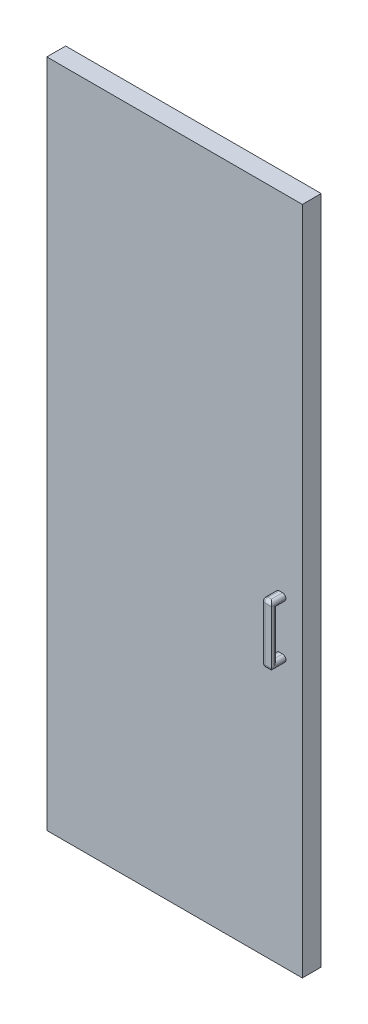
ISO-10303-21;
HEADER;
FILE_DESCRIPTION(('STEP AP214'),'2;1');
FILE_NAME('part.step','',(''),(''),'','','');
FILE_SCHEMA(('AUTOMOTIVE_DESIGN { 1 0 10303 214 1 1 1 1 }'));
ENDSEC;
DATA;
#1=APPLICATION_CONTEXT('core data for automotive mechanical design processes');
#2=APPLICATION_PROTOCOL_DEFINITION('international standard','automotive_design',2000,#1);
#3=PRODUCT_CONTEXT('',#1,'mechanical');
#4=PRODUCT('Part','Part','',(#3));
#5=PRODUCT_RELATED_PRODUCT_CATEGORY('part','',(#4));
#6=PRODUCT_DEFINITION_FORMATION('','',#4);
#7=PRODUCT_DEFINITION_CONTEXT('part definition',#1,'design');
#8=PRODUCT_DEFINITION('design','',#6,#7);
#9=PRODUCT_DEFINITION_SHAPE('','',#8);
#10=(LENGTH_UNIT() NAMED_UNIT(*) SI_UNIT(.MILLI.,.METRE.));
#11=(NAMED_UNIT(*) PLANE_ANGLE_UNIT() SI_UNIT($,.RADIAN.));
#12=(NAMED_UNIT(*) SI_UNIT($,.STERADIAN.) SOLID_ANGLE_UNIT());
#13=UNCERTAINTY_MEASURE_WITH_UNIT(LENGTH_MEASURE(1.E-05),#10,'distance_accuracy_value','');
#14=(GEOMETRIC_REPRESENTATION_CONTEXT(3) GLOBAL_UNCERTAINTY_ASSIGNED_CONTEXT((#13)) GLOBAL_UNIT_ASSIGNED_CONTEXT((#10,
#11,#12)) REPRESENTATION_CONTEXT('',''));
#15=CARTESIAN_POINT('',(0.,0.,0.));
#16=DIRECTION('',(0.,0.,1.));
#17=DIRECTION('',(1.,0.,0.));
#18=AXIS2_PLACEMENT_3D('',#15,#16,#17);
#19=CARTESIAN_POINT('',(0.,0.,0.));
#20=DIRECTION('',(0.,0.,1.));
#21=DIRECTION('',(1.,0.,0.));
#22=AXIS2_PLACEMENT_3D('',#19,#20,#21);
#23=PLANE('',#22);
#24=DIRECTION('',(-1.,0.,0.));
#25=VECTOR('',#24,1.);
#26=CARTESIAN_POINT('',(0.,446.201837212028,0.));
#27=LINE('',#26,#25);
#28=CARTESIAN_POINT('',(0.,446.201837212028,0.));
#29=VERTEX_POINT('',#28);
#30=CARTESIAN_POINT('',(-775.,446.201837212028,0.));
#31=VERTEX_POINT('',#30);
#32=EDGE_CURVE('E257',#29,#31,#27,.T.);
#33=ORIENTED_EDGE('',*,*,#32,.F.);
#34=DIRECTION('',(0.,1.,0.));
#35=VECTOR('',#34,1.);
#36=CARTESIAN_POINT('',(0.,0.,0.));
#37=LINE('',#36,#35);
#38=CARTESIAN_POINT('',(0.,-1585.79816278797,0.));
#39=VERTEX_POINT('',#38);
#40=EDGE_CURVE('E275',#39,#29,#37,.T.);
#41=ORIENTED_EDGE('',*,*,#40,.F.);
#42=DIRECTION('',(1.,0.,0.));
#43=VECTOR('',#42,1.);
#44=CARTESIAN_POINT('',(-775.,-1585.79816278797,0.));
#45=LINE('',#44,#43);
#46=CARTESIAN_POINT('',(-775.,-1585.79816278797,0.));
#47=VERTEX_POINT('',#46);
#48=EDGE_CURVE('E286',#47,#39,#45,.T.);
#49=ORIENTED_EDGE('',*,*,#48,.F.);
#50=DIRECTION('',(0.,-1.,0.));
#51=VECTOR('',#50,1.);
#52=CARTESIAN_POINT('',(-775.,446.201837212028,0.));
#53=LINE('',#52,#51);
#54=EDGE_CURVE('E284',#31,#47,#53,.T.);
#55=ORIENTED_EDGE('',*,*,#54,.F.);
#56=EDGE_LOOP('',(#33,#41,#49,#55));
#57=FACE_BOUND('',#56,.T.);
#58=DIRECTION('',(0.,1.,0.));
#59=VECTOR('',#58,1.);
#60=CARTESIAN_POINT('',(-145.,-924.798162787972,0.));
#61=LINE('',#60,#59);
#62=CARTESIAN_POINT('',(-145.,-924.798162787972,0.));
#63=VERTEX_POINT('',#62);
#64=CARTESIAN_POINT('',(-145.,-464.798162787972,0.));
#65=VERTEX_POINT('',#64);
#66=EDGE_CURVE('E233',#63,#65,#61,.T.);
#67=ORIENTED_EDGE('',*,*,#66,.F.);
#68=DIRECTION('',(-1.,0.,0.));
#69=VECTOR('',#68,1.);
#70=CARTESIAN_POINT('',(-25.,-924.798162787972,0.));
#71=LINE('',#70,#69);
#72=CARTESIAN_POINT('',(-25.,-924.798162787972,0.));
#73=VERTEX_POINT('',#72);
#74=EDGE_CURVE('E230',#73,#63,#71,.T.);
#75=ORIENTED_EDGE('',*,*,#74,.F.);
#76=DIRECTION('',(0.,-1.,0.));
#77=VECTOR('',#76,1.);
#78=CARTESIAN_POINT('',(-25.,-924.798162787972,0.));
#79=LINE('',#78,#77);
#80=CARTESIAN_POINT('',(-25.,-464.798162787972,0.));
#81=VERTEX_POINT('',#80);
#82=EDGE_CURVE('E61',#81,#73,#79,.T.);
#83=ORIENTED_EDGE('',*,*,#82,.F.);
#84=DIRECTION('',(1.,0.,0.));
#85=VECTOR('',#84,1.);
#86=CARTESIAN_POINT('',(-25.,-464.798162787972,0.));
#87=LINE('',#86,#85);
#88=EDGE_CURVE('E56',#65,#81,#87,.T.);
#89=ORIENTED_EDGE('',*,*,#88,.F.);
#90=EDGE_LOOP('',(#67,#75,#83,#89));
#91=FACE_BOUND('',#90,.T.);
#92=ADVANCED_FACE('F39',(#57,#91),#23,.F.);
#93=CARTESIAN_POINT('',(-79.9999999999999,-603.798162787972,101.15));
#94=DIRECTION('',(1.,0.,0.));
#95=DIRECTION('',(0.,1.,0.));
#96=AXIS2_PLACEMENT_3D('',#93,#94,#95);
#97=PLANE('',#96);
#98=DIRECTION('',(0.,-1.,0.));
#99=VECTOR('',#98,1.);
#100=CARTESIAN_POINT('',(-79.9999999999999,-603.798162787972,57.15));
#101=LINE('',#100,#99);
#102=CARTESIAN_POINT('',(-79.9999999999999,-774.798162787972,57.15));
#103=VERTEX_POINT('',#102);
#104=CARTESIAN_POINT('',(-79.9999999999999,-775.798162787972,57.15));
#105=VERTEX_POINT('',#104);
#106=EDGE_CURVE('E265',#103,#105,#101,.T.);
#107=ORIENTED_EDGE('',*,*,#106,.T.);
#108=DIRECTION('',(0.,0.,-1.));
#109=VECTOR('',#108,1.);
#110=CARTESIAN_POINT('',(-79.9999999999999,-775.798162787972,101.15));
#111=LINE('',#110,#109);
#112=CARTESIAN_POINT('',(-79.9999999999999,-775.798162787972,91.15));
#113=VERTEX_POINT('',#112);
#114=EDGE_CURVE('E328',#105,#113,#111,.F.);
#115=ORIENTED_EDGE('',*,*,#114,.T.);
#116=DIRECTION('',(0.,-1.,0.));
#117=VECTOR('',#116,1.);
#118=CARTESIAN_POINT('',(-79.9999999999999,-603.798162787972,91.15));
#119=LINE('',#118,#117);
#120=CARTESIAN_POINT('',(-79.9999999999999,-774.798162787972,91.15));
#121=VERTEX_POINT('',#120);
#122=EDGE_CURVE('E324',#113,#121,#119,.F.);
#123=ORIENTED_EDGE('',*,*,#122,.T.);
#124=DIRECTION('',(0.,0.,-1.));
#125=VECTOR('',#124,1.);
#126=CARTESIAN_POINT('',(-79.9999999999999,-774.798162787972,57.15));
#127=LINE('',#126,#125);
#128=EDGE_CURVE('E326',#121,#103,#127,.T.);
#129=ORIENTED_EDGE('',*,*,#128,.T.);
#130=EDGE_LOOP('',(#107,#115,#123,#129));
#131=FACE_BOUND('',#130,.T.);
#132=ADVANCED_FACE('F497',(#131),#97,.F.);
#133=CARTESIAN_POINT('',(-49.9999999999999,-603.798162787972,101.15));
#134=DIRECTION('',(-1.,0.,0.));
#135=DIRECTION('',(0.,-1.,0.));
#136=AXIS2_PLACEMENT_3D('',#133,#134,#135);
#137=PLANE('',#136);
#138=DIRECTION('',(0.,1.,0.));
#139=VECTOR('',#138,1.);
#140=CARTESIAN_POINT('',(-49.9999999999999,-603.798162787972,57.15));
#141=LINE('',#140,#139);
#142=CARTESIAN_POINT('',(-49.9999999999999,-614.798162787972,57.15));
#143=VERTEX_POINT('',#142);
#144=CARTESIAN_POINT('',(-49.9999999999999,-613.798162787972,57.15));
#145=VERTEX_POINT('',#144);
#146=EDGE_CURVE('E243',#143,#145,#141,.T.);
#147=ORIENTED_EDGE('',*,*,#146,.T.);
#148=DIRECTION('',(0.,0.,-1.));
#149=VECTOR('',#148,1.);
#150=CARTESIAN_POINT('',(-49.9999999999999,-613.798162787972,101.15));
#151=LINE('',#150,#149);
#152=CARTESIAN_POINT('',(-49.9999999999999,-613.798162787972,101.15));
#153=VERTEX_POINT('',#152);
#154=EDGE_CURVE('E343',#145,#153,#151,.F.);
#155=ORIENTED_EDGE('',*,*,#154,.T.);
#156=DIRECTION('',(0.,1.,0.));
#157=VECTOR('',#156,1.);
#158=CARTESIAN_POINT('',(-49.9999999999999,-603.798162787972,101.15));
#159=LINE('',#158,#157);
#160=CARTESIAN_POINT('',(-49.9999999999999,-775.798162787972,101.15));
#161=VERTEX_POINT('',#160);
#162=EDGE_CURVE('E254',#161,#153,#159,.T.);
#163=ORIENTED_EDGE('',*,*,#162,.F.);
#164=DIRECTION('',(0.,0.,-1.));
#165=VECTOR('',#164,1.);
#166=CARTESIAN_POINT('',(-49.9999999999999,-775.798162787972,101.15));
#167=LINE('',#166,#165);
#168=CARTESIAN_POINT('',(-49.9999999999999,-775.798162787972,57.15));
#169=VERTEX_POINT('',#168);
#170=EDGE_CURVE('E335',#161,#169,#167,.T.);
#171=ORIENTED_EDGE('',*,*,#170,.T.);
#172=CARTESIAN_POINT('',(-49.9999999999999,-774.798162787972,57.15));
#173=VERTEX_POINT('',#172);
#174=EDGE_CURVE('E259',#169,#173,#141,.T.);
#175=ORIENTED_EDGE('',*,*,#174,.T.);
#176=DIRECTION('',(0.,0.,-1.));
#177=VECTOR('',#176,1.);
#178=CARTESIAN_POINT('',(-49.9999999999999,-774.798162787972,83.15));
#179=LINE('',#178,#177);
#180=CARTESIAN_POINT('',(-49.9999999999999,-774.798162787972,93.15));
#181=VERTEX_POINT('',#180);
#182=EDGE_CURVE('E337',#173,#181,#179,.F.);
#183=ORIENTED_EDGE('',*,*,#182,.T.);
#184=DIRECTION('',(0.,-1.,0.));
#185=VECTOR('',#184,1.);
#186=CARTESIAN_POINT('',(-49.9999999999999,-624.798162787972,93.15));
#187=LINE('',#186,#185);
#188=CARTESIAN_POINT('',(-49.9999999999999,-614.798162787972,93.15));
#189=VERTEX_POINT('',#188);
#190=EDGE_CURVE('E339',#181,#189,#187,.F.);
#191=ORIENTED_EDGE('',*,*,#190,.T.);
#192=DIRECTION('',(0.,0.,1.));
#193=VECTOR('',#192,1.);
#194=CARTESIAN_POINT('',(-49.9999999999999,-614.798162787972,57.15));
#195=LINE('',#194,#193);
#196=EDGE_CURVE('E341',#189,#143,#195,.F.);
#197=ORIENTED_EDGE('',*,*,#196,.T.);
#198=EDGE_LOOP('',(#147,#155,#163,#171,#175,#183,#191,#197));
#199=FACE_BOUND('',#198,.T.);
#200=ADVANCED_FACE('F417',(#199),#137,.F.);
#201=DIRECTION('',(0.,-1.,0.));
#202=VECTOR('',#201,1.);
#203=CARTESIAN_POINT('',(-79.9999999999999,-603.798162787972,91.15));
#204=LINE('',#203,#202);
#205=CARTESIAN_POINT('',(-79.9999999999999,-614.798162787972,91.15));
#206=VERTEX_POINT('',#205);
#207=CARTESIAN_POINT('',(-79.9999999999999,-613.798162787972,91.15));
#208=VERTEX_POINT('',#207);
#209=EDGE_CURVE('E318',#206,#208,#204,.F.);
#210=ORIENTED_EDGE('',*,*,#209,.T.);
#211=DIRECTION('',(0.,0.,-1.));
#212=VECTOR('',#211,1.);
#213=CARTESIAN_POINT('',(-79.9999999999999,-613.798162787972,101.15));
#214=LINE('',#213,#212);
#215=CARTESIAN_POINT('',(-79.9999999999999,-613.798162787972,57.15));
#216=VERTEX_POINT('',#215);
#217=EDGE_CURVE('E322',#208,#216,#214,.T.);
#218=ORIENTED_EDGE('',*,*,#217,.T.);
#219=CARTESIAN_POINT('',(-79.9999999999999,-614.798162787972,57.15));
#220=VERTEX_POINT('',#219);
#221=EDGE_CURVE('E266',#216,#220,#101,.T.);
#222=ORIENTED_EDGE('',*,*,#221,.T.);
#223=DIRECTION('',(0.,0.,1.));
#224=VECTOR('',#223,1.);
#225=CARTESIAN_POINT('',(-79.9999999999999,-614.798162787972,83.15));
#226=LINE('',#225,#224);
#227=EDGE_CURVE('E320',#220,#206,#226,.T.);
#228=ORIENTED_EDGE('',*,*,#227,.T.);
#229=EDGE_LOOP('',(#210,#218,#222,#228));
#230=FACE_BOUND('',#229,.T.);
#231=ADVANCED_FACE('F503',(#230),#97,.F.);
#232=CARTESIAN_POINT('',(0.,0.,57.15));
#233=DIRECTION('',(0.,0.,1.));
#234=DIRECTION('',(1.,0.,0.));
#235=AXIS2_PLACEMENT_3D('',#232,#233,#234);
#236=PLANE('',#235);
#237=DIRECTION('',(-1.,0.,0.));
#238=VECTOR('',#237,1.);
#239=CARTESIAN_POINT('',(-35.9999999999999,-764.798162787972,57.15));
#240=LINE('',#239,#238);
#241=CARTESIAN_POINT('',(-59.9999999999999,-764.798162787972,57.15));
#242=VERTEX_POINT('',#241);
#243=CARTESIAN_POINT('',(-69.9999999999999,-764.798162787972,57.15));
#244=VERTEX_POINT('',#243);
#245=EDGE_CURVE('E240',#242,#244,#240,.T.);
#246=ORIENTED_EDGE('',*,*,#245,.F.);
#247=CARTESIAN_POINT('',(-59.9999999999999,-774.798162787972,57.15));
#248=DIRECTION('',(0.,0.,1.));
#249=DIRECTION('',(1.,0.,0.));
#250=AXIS2_PLACEMENT_3D('',#247,#248,#249);
#251=CIRCLE('',#250,10.);
#252=EDGE_CURVE('E363',#242,#173,#251,.F.);
#253=ORIENTED_EDGE('',*,*,#252,.T.);
#254=ORIENTED_EDGE('',*,*,#174,.F.);
#255=CARTESIAN_POINT('',(-59.9999999999999,-775.798162787972,57.15));
#256=DIRECTION('',(0.,0.,1.));
#257=DIRECTION('',(1.,0.,0.));
#258=AXIS2_PLACEMENT_3D('',#255,#256,#257);
#259=CIRCLE('',#258,10.);
#260=CARTESIAN_POINT('',(-59.9999999999999,-785.798162787972,57.15));
#261=VERTEX_POINT('',#260);
#262=EDGE_CURVE('E365',#169,#261,#259,.F.);
#263=ORIENTED_EDGE('',*,*,#262,.T.);
#264=DIRECTION('',(1.,0.,0.));
#265=VECTOR('',#264,1.);
#266=CARTESIAN_POINT('',(-79.9999999999999,-785.798162787972,57.15));
#267=LINE('',#266,#265);
#268=CARTESIAN_POINT('',(-69.9999999999999,-785.798162787972,57.15));
#269=VERTEX_POINT('',#268);
#270=EDGE_CURVE('E258',#269,#261,#267,.T.);
#271=ORIENTED_EDGE('',*,*,#270,.F.);
#272=CARTESIAN_POINT('',(-69.9999999999999,-775.798162787972,57.15));
#273=DIRECTION('',(0.,0.,1.));
#274=DIRECTION('',(1.,0.,0.));
#275=AXIS2_PLACEMENT_3D('',#272,#273,#274);
#276=CIRCLE('',#275,10.);
#277=EDGE_CURVE('E48',#269,#105,#276,.F.);
#278=ORIENTED_EDGE('',*,*,#277,.T.);
#279=ORIENTED_EDGE('',*,*,#106,.F.);
#280=CARTESIAN_POINT('',(-69.9999999999999,-774.798162787972,57.15));
#281=DIRECTION('',(0.,0.,1.));
#282=DIRECTION('',(1.,0.,0.));
#283=AXIS2_PLACEMENT_3D('',#280,#281,#282);
#284=CIRCLE('',#283,10.);
#285=EDGE_CURVE('E11',#103,#244,#284,.F.);
#286=ORIENTED_EDGE('',*,*,#285,.T.);
#287=EDGE_LOOP('',(#246,#253,#254,#263,#271,#278,#279,#286));
#288=FACE_BOUND('',#287,.T.);
#289=ORIENTED_EDGE('',*,*,#146,.F.);
#290=CARTESIAN_POINT('',(-59.9999999999999,-614.798162787972,57.15));
#291=DIRECTION('',(0.,0.,1.));
#292=DIRECTION('',(1.,0.,0.));
#293=AXIS2_PLACEMENT_3D('',#290,#291,#292);
#294=CIRCLE('',#293,10.);
#295=CARTESIAN_POINT('',(-59.9999999999999,-624.798162787972,57.15));
#296=VERTEX_POINT('',#295);
#297=EDGE_CURVE('E361',#143,#296,#294,.F.);
#298=ORIENTED_EDGE('',*,*,#297,.T.);
#299=DIRECTION('',(-1.,0.,0.));
#300=VECTOR('',#299,1.);
#301=CARTESIAN_POINT('',(-35.9999999999999,-624.798162787972,57.15));
#302=LINE('',#301,#300);
#303=CARTESIAN_POINT('',(-69.9999999999999,-624.798162787972,57.15));
#304=VERTEX_POINT('',#303);
#305=EDGE_CURVE('E244',#296,#304,#302,.T.);
#306=ORIENTED_EDGE('',*,*,#305,.T.);
#307=CARTESIAN_POINT('',(-69.9999999999999,-614.798162787972,57.15));
#308=DIRECTION('',(0.,0.,1.));
#309=DIRECTION('',(1.,0.,0.));
#310=AXIS2_PLACEMENT_3D('',#307,#308,#309);
#311=CIRCLE('',#310,10.);
#312=EDGE_CURVE('E357',#304,#220,#311,.F.);
#313=ORIENTED_EDGE('',*,*,#312,.T.);
#314=ORIENTED_EDGE('',*,*,#221,.F.);
#315=CARTESIAN_POINT('',(-69.9999999999999,-613.798162787972,57.15));
#316=DIRECTION('',(0.,0.,1.));
#317=DIRECTION('',(1.,0.,0.));
#318=AXIS2_PLACEMENT_3D('',#315,#316,#317);
#319=CIRCLE('',#318,10.);
#320=CARTESIAN_POINT('',(-69.9999999999999,-603.798162787972,57.15));
#321=VERTEX_POINT('',#320);
#322=EDGE_CURVE('E355',#216,#321,#319,.F.);
#323=ORIENTED_EDGE('',*,*,#322,.T.);
#324=DIRECTION('',(-1.,0.,0.));
#325=VECTOR('',#324,1.);
#326=CARTESIAN_POINT('',(-79.9999999999999,-603.798162787972,57.15));
#327=LINE('',#326,#325);
#328=CARTESIAN_POINT('',(-59.9999999999999,-603.798162787972,57.15));
#329=VERTEX_POINT('',#328);
#330=EDGE_CURVE('E262',#329,#321,#327,.T.);
#331=ORIENTED_EDGE('',*,*,#330,.F.);
#332=CARTESIAN_POINT('',(-59.9999999999999,-613.798162787972,57.15));
#333=DIRECTION('',(0.,0.,1.));
#334=DIRECTION('',(1.,0.,0.));
#335=AXIS2_PLACEMENT_3D('',#332,#333,#334);
#336=CIRCLE('',#335,10.);
#337=EDGE_CURVE('E359',#329,#145,#336,.F.);
#338=ORIENTED_EDGE('',*,*,#337,.T.);
#339=EDGE_LOOP('',(#289,#298,#306,#313,#314,#323,#331,#338));
#340=FACE_BOUND('',#339,.T.);
#341=DIRECTION('',(-1.,0.,0.));
#342=VECTOR('',#341,1.);
#343=CARTESIAN_POINT('',(0.,446.201837212028,57.15));
#344=LINE('',#343,#342);
#345=CARTESIAN_POINT('',(0.,446.201837212028,57.15));
#346=VERTEX_POINT('',#345);
#347=CARTESIAN_POINT('',(-775.,446.201837212028,57.15));
#348=VERTEX_POINT('',#347);
#349=EDGE_CURVE('E271',#346,#348,#344,.T.);
#350=ORIENTED_EDGE('',*,*,#349,.T.);
#351=DIRECTION('',(0.,-1.,0.));
#352=VECTOR('',#351,1.);
#353=CARTESIAN_POINT('',(-775.,446.201837212028,57.15));
#354=LINE('',#353,#352);
#355=CARTESIAN_POINT('',(-775.,-1585.79816278797,57.15));
#356=VERTEX_POINT('',#355);
#357=EDGE_CURVE('E274',#348,#356,#354,.T.);
#358=ORIENTED_EDGE('',*,*,#357,.T.);
#359=DIRECTION('',(1.,0.,0.));
#360=VECTOR('',#359,1.);
#361=CARTESIAN_POINT('',(-775.,-1585.79816278797,57.15));
#362=LINE('',#361,#360);
#363=CARTESIAN_POINT('',(0.,-1585.79816278797,57.15));
#364=VERTEX_POINT('',#363);
#365=EDGE_CURVE('E277',#356,#364,#362,.T.);
#366=ORIENTED_EDGE('',*,*,#365,.T.);
#367=DIRECTION('',(0.,1.,0.));
#368=VECTOR('',#367,1.);
#369=CARTESIAN_POINT('',(0.,-1585.79816278797,57.15));
#370=LINE('',#369,#368);
#371=EDGE_CURVE('E279',#364,#346,#370,.T.);
#372=ORIENTED_EDGE('',*,*,#371,.T.);
#373=EDGE_LOOP('',(#350,#358,#366,#372));
#374=FACE_BOUND('',#373,.T.);
#375=ADVANCED_FACE('F421',(#288,#340,#374),#236,.T.);
#376=CARTESIAN_POINT('',(0.,446.201837212028,57.15));
#377=DIRECTION('',(0.,-1.,0.));
#378=DIRECTION('',(1.,0.,0.));
#379=AXIS2_PLACEMENT_3D('',#376,#377,#378);
#380=PLANE('',#379);
#381=ORIENTED_EDGE('',*,*,#32,.T.);
#382=DIRECTION('',(0.,0.,-1.));
#383=VECTOR('',#382,1.);
#384=CARTESIAN_POINT('',(-775.,446.201837212028,57.15));
#385=LINE('',#384,#383);
#386=EDGE_CURVE('E298',#348,#31,#385,.T.);
#387=ORIENTED_EDGE('',*,*,#386,.F.);
#388=ORIENTED_EDGE('',*,*,#349,.F.);
#389=DIRECTION('',(0.,0.,-1.));
#390=VECTOR('',#389,1.);
#391=CARTESIAN_POINT('',(0.,446.201837212028,57.15));
#392=LINE('',#391,#390);
#393=EDGE_CURVE('E281',#346,#29,#392,.T.);
#394=ORIENTED_EDGE('',*,*,#393,.T.);
#395=EDGE_LOOP('',(#381,#387,#388,#394));
#396=FACE_BOUND('',#395,.T.);
#397=ADVANCED_FACE('F544',(#396),#380,.F.);
#398=CARTESIAN_POINT('',(-775.,446.201837212028,57.15));
#399=DIRECTION('',(1.,0.,0.));
#400=DIRECTION('',(0.,1.,0.));
#401=AXIS2_PLACEMENT_3D('',#398,#399,#400);
#402=PLANE('',#401);
#403=ORIENTED_EDGE('',*,*,#54,.T.);
#404=DIRECTION('',(0.,0.,-1.));
#405=VECTOR('',#404,1.);
#406=CARTESIAN_POINT('',(-775.,-1585.79816278797,57.15));
#407=LINE('',#406,#405);
#408=EDGE_CURVE('E295',#356,#47,#407,.T.);
#409=ORIENTED_EDGE('',*,*,#408,.F.);
#410=ORIENTED_EDGE('',*,*,#357,.F.);
#411=ORIENTED_EDGE('',*,*,#386,.T.);
#412=EDGE_LOOP('',(#403,#409,#410,#411));
#413=FACE_BOUND('',#412,.T.);
#414=ADVANCED_FACE('F540',(#413),#402,.F.);
#415=CARTESIAN_POINT('',(-775.,-1585.79816278797,57.15));
#416=DIRECTION('',(0.,1.,0.));
#417=DIRECTION('',(0.,0.,1.));
#418=AXIS2_PLACEMENT_3D('',#415,#416,#417);
#419=PLANE('',#418);
#420=ORIENTED_EDGE('',*,*,#48,.T.);
#421=DIRECTION('',(0.,0.,-1.));
#422=VECTOR('',#421,1.);
#423=CARTESIAN_POINT('',(0.,-1585.79816278797,57.15));
#424=LINE('',#423,#422);
#425=EDGE_CURVE('E292',#364,#39,#424,.T.);
#426=ORIENTED_EDGE('',*,*,#425,.F.);
#427=ORIENTED_EDGE('',*,*,#365,.F.);
#428=ORIENTED_EDGE('',*,*,#408,.T.);
#429=EDGE_LOOP('',(#420,#426,#427,#428));
#430=FACE_BOUND('',#429,.T.);
#431=ADVANCED_FACE('F536',(#430),#419,.F.);
#432=CARTESIAN_POINT('',(0.,0.,57.15));
#433=DIRECTION('',(-1.,0.,0.));
#434=DIRECTION('',(0.,0.,1.));
#435=AXIS2_PLACEMENT_3D('',#432,#433,#434);
#436=PLANE('',#435);
#437=ORIENTED_EDGE('',*,*,#40,.T.);
#438=ORIENTED_EDGE('',*,*,#393,.F.);
#439=ORIENTED_EDGE('',*,*,#371,.F.);
#440=ORIENTED_EDGE('',*,*,#425,.T.);
#441=EDGE_LOOP('',(#437,#438,#439,#440));
#442=FACE_BOUND('',#441,.T.);
#443=ADVANCED_FACE('F533',(#442),#436,.F.);
#444=CARTESIAN_POINT('',(-79.9999999999999,-603.798162787972,101.15));
#445=DIRECTION('',(0.,-1.,0.));
#446=DIRECTION('',(0.,0.,-1.));
#447=AXIS2_PLACEMENT_3D('',#444,#445,#446);
#448=PLANE('',#447);
#449=ORIENTED_EDGE('',*,*,#330,.T.);
#450=DIRECTION('',(0.,0.,-1.));
#451=VECTOR('',#450,1.);
#452=CARTESIAN_POINT('',(-69.9999999999999,-603.798162787972,101.15));
#453=LINE('',#452,#451);
#454=CARTESIAN_POINT('',(-69.9999999999999,-603.798162787972,91.15));
#455=VERTEX_POINT('',#454);
#456=EDGE_CURVE('E312',#321,#455,#453,.F.);
#457=ORIENTED_EDGE('',*,*,#456,.T.);
#458=DIRECTION('',(-1.,0.,0.));
#459=VECTOR('',#458,1.);
#460=CARTESIAN_POINT('',(-49.9999999999999,-603.798162787972,91.15));
#461=LINE('',#460,#459);
#462=CARTESIAN_POINT('',(-59.9999999999999,-603.798162787972,91.15));
#463=VERTEX_POINT('',#462);
#464=EDGE_CURVE('E310',#455,#463,#461,.F.);
#465=ORIENTED_EDGE('',*,*,#464,.T.);
#466=DIRECTION('',(0.,0.,-1.));
#467=VECTOR('',#466,1.);
#468=CARTESIAN_POINT('',(-59.9999999999999,-603.798162787972,101.15));
#469=LINE('',#468,#467);
#470=EDGE_CURVE('E308',#463,#329,#469,.T.);
#471=ORIENTED_EDGE('',*,*,#470,.T.);
#472=EDGE_LOOP('',(#449,#457,#465,#471));
#473=FACE_BOUND('',#472,.T.);
#474=ADVANCED_FACE('F511',(#473),#448,.F.);
#475=CARTESIAN_POINT('',(-79.9999999999999,-785.798162787972,101.15));
#476=DIRECTION('',(0.,1.,0.));
#477=DIRECTION('',(0.,0.,1.));
#478=AXIS2_PLACEMENT_3D('',#475,#476,#477);
#479=PLANE('',#478);
#480=ORIENTED_EDGE('',*,*,#270,.T.);
#481=DIRECTION('',(0.,0.,-1.));
#482=VECTOR('',#481,1.);
#483=CARTESIAN_POINT('',(-59.9999999999999,-785.798162787972,101.15));
#484=LINE('',#483,#482);
#485=CARTESIAN_POINT('',(-59.9999999999999,-785.798162787972,91.15));
#486=VERTEX_POINT('',#485);
#487=EDGE_CURVE('E353',#261,#486,#484,.F.);
#488=ORIENTED_EDGE('',*,*,#487,.T.);
#489=DIRECTION('',(1.,0.,0.));
#490=VECTOR('',#489,1.);
#491=CARTESIAN_POINT('',(-79.9999999999999,-785.798162787972,91.15));
#492=LINE('',#491,#490);
#493=CARTESIAN_POINT('',(-69.9999999999999,-785.798162787972,91.15));
#494=VERTEX_POINT('',#493);
#495=EDGE_CURVE('E349',#486,#494,#492,.F.);
#496=ORIENTED_EDGE('',*,*,#495,.T.);
#497=DIRECTION('',(0.,0.,-1.));
#498=VECTOR('',#497,1.);
#499=CARTESIAN_POINT('',(-69.9999999999999,-785.798162787972,101.15));
#500=LINE('',#499,#498);
#501=EDGE_CURVE('E351',#494,#269,#500,.T.);
#502=ORIENTED_EDGE('',*,*,#501,.T.);
#503=EDGE_LOOP('',(#480,#488,#496,#502));
#504=FACE_BOUND('',#503,.T.);
#505=ADVANCED_FACE('F492',(#504),#479,.F.);
#506=CARTESIAN_POINT('',(0.,0.,101.15));
#507=DIRECTION('',(0.,0.,1.));
#508=DIRECTION('',(1.,0.,0.));
#509=AXIS2_PLACEMENT_3D('',#506,#507,#508);
#510=PLANE('',#509);
#511=ORIENTED_EDGE('',*,*,#162,.T.);
#512=DIRECTION('',(-1.,0.,0.));
#513=VECTOR('',#512,1.);
#514=CARTESIAN_POINT('',(-79.9999999999999,-613.798162787972,101.15));
#515=LINE('',#514,#513);
#516=CARTESIAN_POINT('',(-69.9999999999999,-613.798162787972,101.15));
#517=VERTEX_POINT('',#516);
#518=EDGE_CURVE('E305',#153,#517,#515,.T.);
#519=ORIENTED_EDGE('',*,*,#518,.T.);
#520=DIRECTION('',(0.,-1.,0.));
#521=VECTOR('',#520,1.);
#522=CARTESIAN_POINT('',(-69.9999999999999,-785.798162787972,101.15));
#523=LINE('',#522,#521);
#524=CARTESIAN_POINT('',(-69.9999999999999,-775.798162787972,101.15));
#525=VERTEX_POINT('',#524);
#526=EDGE_CURVE('E303',#517,#525,#523,.T.);
#527=ORIENTED_EDGE('',*,*,#526,.T.);
#528=DIRECTION('',(1.,0.,0.));
#529=VECTOR('',#528,1.);
#530=CARTESIAN_POINT('',(-49.9999999999999,-775.798162787972,101.15));
#531=LINE('',#530,#529);
#532=EDGE_CURVE('E301',#525,#161,#531,.T.);
#533=ORIENTED_EDGE('',*,*,#532,.T.);
#534=EDGE_LOOP('',(#511,#519,#527,#533));
#535=FACE_BOUND('',#534,.T.);
#536=ADVANCED_FACE('F475',(#535),#510,.T.);
#537=CARTESIAN_POINT('',(-35.9999999999999,-764.798162787972,0.));
#538=DIRECTION('',(0.,1.,0.));
#539=DIRECTION('',(-1.,0.,0.));
#540=AXIS2_PLACEMENT_3D('',#537,#538,#539);
#541=PLANE('',#540);
#542=DIRECTION('',(-1.,0.,0.));
#543=VECTOR('',#542,1.);
#544=CARTESIAN_POINT('',(-35.9999999999999,-764.798162787972,83.15));
#545=LINE('',#544,#543);
#546=CARTESIAN_POINT('',(-59.9999999999999,-764.798162787972,83.15));
#547=VERTEX_POINT('',#546);
#548=CARTESIAN_POINT('',(-69.9999999999999,-764.798162787972,83.15));
#549=VERTEX_POINT('',#548);
#550=EDGE_CURVE('E250',#547,#549,#545,.T.);
#551=ORIENTED_EDGE('',*,*,#550,.F.);
#552=DIRECTION('',(0.,0.,-1.));
#553=VECTOR('',#552,1.);
#554=CARTESIAN_POINT('',(-59.9999999999999,-764.798162787972,57.15));
#555=LINE('',#554,#553);
#556=EDGE_CURVE('E347',#547,#242,#555,.T.);
#557=ORIENTED_EDGE('',*,*,#556,.T.);
#558=ORIENTED_EDGE('',*,*,#245,.T.);
#559=DIRECTION('',(0.,0.,-1.));
#560=VECTOR('',#559,1.);
#561=CARTESIAN_POINT('',(-69.9999999999999,-764.798162787972,83.15));
#562=LINE('',#561,#560);
#563=EDGE_CURVE('E345',#244,#549,#562,.F.);
#564=ORIENTED_EDGE('',*,*,#563,.T.);
#565=EDGE_LOOP('',(#551,#557,#558,#564));
#566=FACE_BOUND('',#565,.T.);
#567=ADVANCED_FACE('F575',(#566),#541,.T.);
#568=CARTESIAN_POINT('',(-35.9999999999999,-624.798162787972,0.));
#569=DIRECTION('',(0.,-1.,0.));
#570=DIRECTION('',(1.,0.,0.));
#571=AXIS2_PLACEMENT_3D('',#568,#569,#570);
#572=PLANE('',#571);
#573=DIRECTION('',(-1.,0.,0.));
#574=VECTOR('',#573,1.);
#575=CARTESIAN_POINT('',(-35.9999999999999,-624.798162787972,83.15));
#576=LINE('',#575,#574);
#577=CARTESIAN_POINT('',(-59.9999999999999,-624.798162787972,83.15));
#578=VERTEX_POINT('',#577);
#579=CARTESIAN_POINT('',(-69.9999999999999,-624.798162787972,83.15));
#580=VERTEX_POINT('',#579);
#581=EDGE_CURVE('E247',#578,#580,#576,.T.);
#582=ORIENTED_EDGE('',*,*,#581,.T.);
#583=DIRECTION('',(0.,0.,1.));
#584=VECTOR('',#583,1.);
#585=CARTESIAN_POINT('',(-69.9999999999999,-624.798162787972,57.15));
#586=LINE('',#585,#584);
#587=EDGE_CURVE('E333',#580,#304,#586,.F.);
#588=ORIENTED_EDGE('',*,*,#587,.T.);
#589=ORIENTED_EDGE('',*,*,#305,.F.);
#590=DIRECTION('',(0.,0.,1.));
#591=VECTOR('',#590,1.);
#592=CARTESIAN_POINT('',(-59.9999999999999,-624.798162787972,83.15));
#593=LINE('',#592,#591);
#594=EDGE_CURVE('E330',#296,#578,#593,.T.);
#595=ORIENTED_EDGE('',*,*,#594,.T.);
#596=EDGE_LOOP('',(#582,#588,#589,#595));
#597=FACE_BOUND('',#596,.T.);
#598=ADVANCED_FACE('F445',(#597),#572,.T.);
#599=CARTESIAN_POINT('',(-36.0000000000001,0.,83.1499999999999));
#600=DIRECTION('',(0.,0.,-1.));
#601=DIRECTION('',(0.,1.,0.));
#602=AXIS2_PLACEMENT_3D('',#599,#600,#601);
#603=PLANE('',#602);
#604=ORIENTED_EDGE('',*,*,#550,.T.);
#605=DIRECTION('',(0.,-1.,0.));
#606=VECTOR('',#605,1.);
#607=CARTESIAN_POINT('',(-69.9999999999999,-624.798162787972,83.15));
#608=LINE('',#607,#606);
#609=EDGE_CURVE('E316',#549,#580,#608,.F.);
#610=ORIENTED_EDGE('',*,*,#609,.T.);
#611=ORIENTED_EDGE('',*,*,#581,.F.);
#612=DIRECTION('',(0.,-1.,0.));
#613=VECTOR('',#612,1.);
#614=CARTESIAN_POINT('',(-59.9999999999999,-764.798162787972,83.15));
#615=LINE('',#614,#613);
#616=EDGE_CURVE('E314',#578,#547,#615,.T.);
#617=ORIENTED_EDGE('',*,*,#616,.T.);
#618=EDGE_LOOP('',(#604,#610,#611,#617));
#619=FACE_BOUND('',#618,.T.);
#620=ADVANCED_FACE('F447',(#619),#603,.T.);
#621=CARTESIAN_POINT('',(-59.9999999999999,-775.798162787972,101.15));
#622=DIRECTION('',(0.,0.,-1.));
#623=DIRECTION('',(-1.,0.,0.));
#624=AXIS2_PLACEMENT_3D('',#621,#622,#623);
#625=CYLINDRICAL_SURFACE('',#624,10.);
#626=ORIENTED_EDGE('',*,*,#262,.F.);
#627=ORIENTED_EDGE('',*,*,#170,.F.);
#628=CARTESIAN_POINT('',(-59.9999999999999,-775.798162787972,91.15));
#629=DIRECTION('',(-0.707106781186547,0.,0.707106781186547));
#630=DIRECTION('',(-0.707106781186547,0.,-0.707106781186547));
#631=AXIS2_PLACEMENT_3D('',#628,#629,#630);
#632=ELLIPSE('',#631,14.1421356237309,10.);
#633=EDGE_CURVE('E253',#486,#161,#632,.T.);
#634=ORIENTED_EDGE('',*,*,#633,.F.);
#635=ORIENTED_EDGE('',*,*,#487,.F.);
#636=EDGE_LOOP('',(#626,#627,#634,#635));
#637=FACE_BOUND('',#636,.T.);
#638=ADVANCED_FACE('F412',(#637),#625,.T.);
#639=CARTESIAN_POINT('',(0.,-775.798162787972,91.15));
#640=DIRECTION('',(-1.,0.,0.));
#641=DIRECTION('',(0.,0.,1.));
#642=AXIS2_PLACEMENT_3D('',#639,#640,#641);
#643=CYLINDRICAL_SURFACE('',#642,10.);
#644=ORIENTED_EDGE('',*,*,#633,.T.);
#645=ORIENTED_EDGE('',*,*,#532,.F.);
#646=CARTESIAN_POINT('',(-69.9999999999999,-775.798162787972,91.15));
#647=DIRECTION('',(-1.,0.,0.));
#648=DIRECTION('',(0.,0.,1.));
#649=AXIS2_PLACEMENT_3D('',#646,#647,#648);
#650=CIRCLE('',#649,10.);
#651=EDGE_CURVE('E398',#494,#525,#650,.T.);
#652=ORIENTED_EDGE('',*,*,#651,.F.);
#653=ORIENTED_EDGE('',*,*,#495,.F.);
#654=EDGE_LOOP('',(#644,#645,#652,#653));
#655=FACE_BOUND('',#654,.T.);
#656=ADVANCED_FACE('F406',(#655),#643,.T.);
#657=CARTESIAN_POINT('',(-69.9999999999999,-775.798162787972,101.15));
#658=DIRECTION('',(0.,0.,-1.));
#659=DIRECTION('',(-1.,0.,0.));
#660=AXIS2_PLACEMENT_3D('',#657,#658,#659);
#661=CYLINDRICAL_SURFACE('',#660,10.);
#662=ORIENTED_EDGE('',*,*,#277,.F.);
#663=ORIENTED_EDGE('',*,*,#501,.F.);
#664=CARTESIAN_POINT('',(-69.9999999999999,-775.798162787972,91.15));
#665=DIRECTION('',(0.,0.,1.));
#666=DIRECTION('',(1.,0.,0.));
#667=AXIS2_PLACEMENT_3D('',#664,#665,#666);
#668=CIRCLE('',#667,10.);
#669=EDGE_CURVE('E395',#113,#494,#668,.T.);
#670=ORIENTED_EDGE('',*,*,#669,.F.);
#671=ORIENTED_EDGE('',*,*,#114,.F.);
#672=EDGE_LOOP('',(#662,#663,#670,#671));
#673=FACE_BOUND('',#672,.T.);
#674=ADVANCED_FACE('F490',(#673),#661,.T.);
#675=CARTESIAN_POINT('',(-69.9999999999999,-775.798162787972,91.15));
#676=DIRECTION('',(0.,-1.,0.));
#677=DIRECTION('',(0.,0.,-1.));
#678=AXIS2_PLACEMENT_3D('',#675,#676,#677);
#679=SPHERICAL_SURFACE('',#678,10.);
#680=ORIENTED_EDGE('',*,*,#669,.T.);
#681=ORIENTED_EDGE('',*,*,#651,.T.);
#682=CARTESIAN_POINT('',(-69.9999999999999,-775.798162787972,91.15));
#683=DIRECTION('',(0.,-1.,0.));
#684=DIRECTION('',(0.,0.,-1.));
#685=AXIS2_PLACEMENT_3D('',#682,#683,#684);
#686=CIRCLE('',#685,10.);
#687=EDGE_CURVE('E388',#113,#525,#686,.F.);
#688=ORIENTED_EDGE('',*,*,#687,.F.);
#689=EDGE_LOOP('',(#680,#681,#688));
#690=FACE_BOUND('',#689,.T.);
#691=ADVANCED_FACE('F484',(#690),#679,.T.);
#692=CARTESIAN_POINT('',(-69.9999999999999,-774.798162787972,101.15));
#693=DIRECTION('',(0.,0.,1.));
#694=DIRECTION('',(1.,0.,0.));
#695=AXIS2_PLACEMENT_3D('',#692,#693,#694);
#696=CYLINDRICAL_SURFACE('',#695,10.);
#697=CARTESIAN_POINT('',(-69.9999999999999,-774.798162787972,93.15));
#698=DIRECTION('',(0.,0.707106781186548,0.707106781186547));
#699=DIRECTION('',(0.,0.707106781186547,-0.707106781186547));
#700=AXIS2_PLACEMENT_3D('',#697,#698,#699);
#701=ELLIPSE('',#700,14.142135623731,10.);
#702=CARTESIAN_POINT('',(-79.9498743710661,-773.798162787972,92.15));
#703=VERTEX_POINT('',#702);
#704=EDGE_CURVE('E393',#549,#703,#701,.T.);
#705=ORIENTED_EDGE('',*,*,#704,.F.);
#706=ORIENTED_EDGE('',*,*,#563,.F.);
#707=ORIENTED_EDGE('',*,*,#285,.F.);
#708=ORIENTED_EDGE('',*,*,#128,.F.);
#709=CARTESIAN_POINT('',(-69.9999999999999,-774.798162787972,91.15));
#710=DIRECTION('',(0.,-0.707106781186547,0.707106781186547));
#711=DIRECTION('',(0.,0.707106781186547,0.707106781186547));
#712=AXIS2_PLACEMENT_3D('',#709,#710,#711);
#713=ELLIPSE('',#712,14.1421356237309,10.);
#714=EDGE_CURVE('E385',#703,#121,#713,.T.);
#715=ORIENTED_EDGE('',*,*,#714,.F.);
#716=EDGE_LOOP('',(#705,#706,#707,#708,#715));
#717=FACE_BOUND('',#716,.T.);
#718=ADVANCED_FACE('F500',(#717),#696,.T.);
#719=CARTESIAN_POINT('',(-69.9999999999999,-603.798162787972,93.15));
#720=DIRECTION('',(0.,1.,0.));
#721=DIRECTION('',(-1.,0.,0.));
#722=AXIS2_PLACEMENT_3D('',#719,#720,#721);
#723=CYLINDRICAL_SURFACE('',#722,10.);
#724=CARTESIAN_POINT('',(-69.9999999999999,-614.798162787972,93.15));
#725=DIRECTION('',(0.,0.707106781186547,-0.707106781186547));
#726=DIRECTION('',(0.,0.707106781186548,0.707106781186547));
#727=AXIS2_PLACEMENT_3D('',#724,#725,#726);
#728=ELLIPSE('',#727,14.1421356237309,10.);
#729=CARTESIAN_POINT('',(-79.9498743710661,-615.798162787972,92.15));
#730=VERTEX_POINT('',#729);
#731=EDGE_CURVE('E391',#580,#730,#728,.T.);
#732=ORIENTED_EDGE('',*,*,#731,.F.);
#733=ORIENTED_EDGE('',*,*,#609,.F.);
#734=ORIENTED_EDGE('',*,*,#704,.T.);
#735=DIRECTION('',(0.,1.,0.));
#736=VECTOR('',#735,1.);
#737=CARTESIAN_POINT('',(-79.9498743710661,-694.798162787972,92.15));
#738=LINE('',#737,#736);
#739=EDGE_CURVE('E382',#730,#703,#738,.F.);
#740=ORIENTED_EDGE('',*,*,#739,.F.);
#741=EDGE_LOOP('',(#732,#733,#734,#740));
#742=FACE_BOUND('',#741,.T.);
#743=ADVANCED_FACE('F451',(#742),#723,.T.);
#744=CARTESIAN_POINT('',(-69.9999999999999,-614.798162787972,101.15));
#745=DIRECTION('',(0.,0.,-1.));
#746=DIRECTION('',(-1.,0.,0.));
#747=AXIS2_PLACEMENT_3D('',#744,#745,#746);
#748=CYLINDRICAL_SURFACE('',#747,10.);
#749=ORIENTED_EDGE('',*,*,#587,.F.);
#750=ORIENTED_EDGE('',*,*,#731,.T.);
#751=CARTESIAN_POINT('',(-69.9999999999999,-614.798162787972,91.15));
#752=DIRECTION('',(0.,-0.707106781186547,-0.707106781186547));
#753=DIRECTION('',(0.,0.707106781186547,-0.707106781186547));
#754=AXIS2_PLACEMENT_3D('',#751,#752,#753);
#755=ELLIPSE('',#754,14.1421356237309,10.);
#756=EDGE_CURVE('E379',#206,#730,#755,.F.);
#757=ORIENTED_EDGE('',*,*,#756,.F.);
#758=ORIENTED_EDGE('',*,*,#227,.F.);
#759=ORIENTED_EDGE('',*,*,#312,.F.);
#760=EDGE_LOOP('',(#749,#750,#757,#758,#759));
#761=FACE_BOUND('',#760,.T.);
#762=ADVANCED_FACE('F458',(#761),#748,.T.);
#763=CARTESIAN_POINT('',(-70.,0.,91.15));
#764=DIRECTION('',(0.,1.,0.));
#765=DIRECTION('',(-1.,0.,0.));
#766=AXIS2_PLACEMENT_3D('',#763,#764,#765);
#767=CYLINDRICAL_SURFACE('',#766,10.);
#768=ORIENTED_EDGE('',*,*,#687,.T.);
#769=ORIENTED_EDGE('',*,*,#526,.F.);
#770=CARTESIAN_POINT('',(-69.9999999999999,-613.798162787972,91.15));
#771=DIRECTION('',(0.,1.,0.));
#772=DIRECTION('',(0.,0.,1.));
#773=AXIS2_PLACEMENT_3D('',#770,#771,#772);
#774=CIRCLE('',#773,10.);
#775=EDGE_CURVE('E376',#208,#517,#774,.T.);
#776=ORIENTED_EDGE('',*,*,#775,.F.);
#777=ORIENTED_EDGE('',*,*,#209,.F.);
#778=ORIENTED_EDGE('',*,*,#756,.T.);
#779=ORIENTED_EDGE('',*,*,#739,.T.);
#780=ORIENTED_EDGE('',*,*,#714,.T.);
#781=ORIENTED_EDGE('',*,*,#122,.F.);
#782=EDGE_LOOP('',(#768,#769,#776,#777,#778,#779,#780,#781));
#783=FACE_BOUND('',#782,.T.);
#784=ADVANCED_FACE('F479',(#783),#767,.T.);
#785=CARTESIAN_POINT('',(-69.9999999999999,-613.798162787972,101.15));
#786=DIRECTION('',(0.,0.,-1.));
#787=DIRECTION('',(-1.,0.,0.));
#788=AXIS2_PLACEMENT_3D('',#785,#786,#787);
#789=CYLINDRICAL_SURFACE('',#788,10.);
#790=ORIENTED_EDGE('',*,*,#322,.F.);
#791=ORIENTED_EDGE('',*,*,#217,.F.);
#792=CARTESIAN_POINT('',(-69.9999999999999,-613.798162787972,91.15));
#793=DIRECTION('',(0.,0.,1.));
#794=DIRECTION('',(1.,0.,0.));
#795=AXIS2_PLACEMENT_3D('',#792,#793,#794);
#796=CIRCLE('',#795,10.);
#797=EDGE_CURVE('E373',#455,#208,#796,.T.);
#798=ORIENTED_EDGE('',*,*,#797,.F.);
#799=ORIENTED_EDGE('',*,*,#456,.F.);
#800=EDGE_LOOP('',(#790,#791,#798,#799));
#801=FACE_BOUND('',#800,.T.);
#802=ADVANCED_FACE('F508',(#801),#789,.T.);
#803=CARTESIAN_POINT('',(-59.9999999999999,-613.798162787972,101.15));
#804=DIRECTION('',(0.,0.,-1.));
#805=DIRECTION('',(-1.,0.,0.));
#806=AXIS2_PLACEMENT_3D('',#803,#804,#805);
#807=CYLINDRICAL_SURFACE('',#806,10.);
#808=ORIENTED_EDGE('',*,*,#337,.F.);
#809=ORIENTED_EDGE('',*,*,#470,.F.);
#810=CARTESIAN_POINT('',(-59.9999999999999,-613.798162787972,91.15));
#811=DIRECTION('',(0.707106781186547,0.,-0.707106781186547));
#812=DIRECTION('',(-0.707106781186547,0.,-0.707106781186547));
#813=AXIS2_PLACEMENT_3D('',#810,#811,#812);
#814=ELLIPSE('',#813,14.1421356237309,10.);
#815=EDGE_CURVE('E370',#153,#463,#814,.F.);
#816=ORIENTED_EDGE('',*,*,#815,.F.);
#817=ORIENTED_EDGE('',*,*,#154,.F.);
#818=EDGE_LOOP('',(#808,#809,#816,#817));
#819=FACE_BOUND('',#818,.T.);
#820=ADVANCED_FACE('F467',(#819),#807,.T.);
#821=CARTESIAN_POINT('',(-69.9999999999999,-613.798162787972,91.15));
#822=DIRECTION('',(-1.,0.,0.));
#823=DIRECTION('',(0.,0.,1.));
#824=AXIS2_PLACEMENT_3D('',#821,#822,#823);
#825=SPHERICAL_SURFACE('',#824,10.);
#826=ORIENTED_EDGE('',*,*,#797,.T.);
#827=ORIENTED_EDGE('',*,*,#775,.T.);
#828=CARTESIAN_POINT('',(-69.9999999999999,-613.798162787972,91.15));
#829=DIRECTION('',(-1.,0.,0.));
#830=DIRECTION('',(0.,0.,1.));
#831=AXIS2_PLACEMENT_3D('',#828,#829,#830);
#832=CIRCLE('',#831,10.);
#833=EDGE_CURVE('E368',#455,#517,#832,.F.);
#834=ORIENTED_EDGE('',*,*,#833,.F.);
#835=EDGE_LOOP('',(#826,#827,#834));
#836=FACE_BOUND('',#835,.T.);
#837=ADVANCED_FACE('F513',(#836),#825,.T.);
#838=CARTESIAN_POINT('',(0.,-613.798162787972,91.15));
#839=DIRECTION('',(1.,0.,0.));
#840=DIRECTION('',(0.,0.,-1.));
#841=AXIS2_PLACEMENT_3D('',#838,#839,#840);
#842=CYLINDRICAL_SURFACE('',#841,10.);
#843=ORIENTED_EDGE('',*,*,#815,.T.);
#844=ORIENTED_EDGE('',*,*,#464,.F.);
#845=ORIENTED_EDGE('',*,*,#833,.T.);
#846=ORIENTED_EDGE('',*,*,#518,.F.);
#847=EDGE_LOOP('',(#843,#844,#845,#846));
#848=FACE_BOUND('',#847,.T.);
#849=ADVANCED_FACE('F472',(#848),#842,.T.);
#850=CARTESIAN_POINT('',(-59.9999999999999,-774.798162787972,0.));
#851=DIRECTION('',(0.,0.,1.));
#852=DIRECTION('',(1.,0.,0.));
#853=AXIS2_PLACEMENT_3D('',#850,#851,#852);
#854=CYLINDRICAL_SURFACE('',#853,10.);
#855=ORIENTED_EDGE('',*,*,#252,.F.);
#856=ORIENTED_EDGE('',*,*,#556,.F.);
#857=CARTESIAN_POINT('',(-59.9999999999999,-774.798162787972,93.15));
#858=DIRECTION('',(0.,0.707106781186548,0.707106781186547));
#859=DIRECTION('',(0.,0.707106781186547,-0.707106781186547));
#860=AXIS2_PLACEMENT_3D('',#857,#858,#859);
#861=ELLIPSE('',#860,14.142135623731,10.);
#862=EDGE_CURVE('E43',#181,#547,#861,.T.);
#863=ORIENTED_EDGE('',*,*,#862,.F.);
#864=ORIENTED_EDGE('',*,*,#182,.F.);
#865=EDGE_LOOP('',(#855,#856,#863,#864));
#866=FACE_BOUND('',#865,.T.);
#867=ADVANCED_FACE('F41',(#866),#854,.T.);
#868=CARTESIAN_POINT('',(-60.,0.,93.1499999999999));
#869=DIRECTION('',(0.,1.,0.));
#870=DIRECTION('',(-1.,0.,0.));
#871=AXIS2_PLACEMENT_3D('',#868,#869,#870);
#872=CYLINDRICAL_SURFACE('',#871,10.);
#873=ORIENTED_EDGE('',*,*,#862,.T.);
#874=ORIENTED_EDGE('',*,*,#616,.F.);
#875=CARTESIAN_POINT('',(-59.9999999999999,-614.798162787972,93.15));
#876=DIRECTION('',(0.,0.707106781186547,-0.707106781186547));
#877=DIRECTION('',(0.,-0.707106781186548,-0.707106781186547));
#878=AXIS2_PLACEMENT_3D('',#875,#876,#877);
#879=ELLIPSE('',#878,14.1421356237309,10.);
#880=EDGE_CURVE('E234',#189,#578,#879,.T.);
#881=ORIENTED_EDGE('',*,*,#880,.F.);
#882=ORIENTED_EDGE('',*,*,#190,.F.);
#883=EDGE_LOOP('',(#873,#874,#881,#882));
#884=FACE_BOUND('',#883,.T.);
#885=ADVANCED_FACE('F439',(#884),#872,.T.);
#886=CARTESIAN_POINT('',(-59.9999999999999,-614.798162787972,0.));
#887=DIRECTION('',(0.,0.,-1.));
#888=DIRECTION('',(-1.,0.,0.));
#889=AXIS2_PLACEMENT_3D('',#886,#887,#888);
#890=CYLINDRICAL_SURFACE('',#889,10.);
#891=ORIENTED_EDGE('',*,*,#297,.F.);
#892=ORIENTED_EDGE('',*,*,#196,.F.);
#893=ORIENTED_EDGE('',*,*,#880,.T.);
#894=ORIENTED_EDGE('',*,*,#594,.F.);
#895=EDGE_LOOP('',(#891,#892,#893,#894));
#896=FACE_BOUND('',#895,.T.);
#897=ADVANCED_FACE('F436',(#896),#890,.T.);
#898=CARTESIAN_POINT('',(-145.,-924.798162787972,-10.));
#899=DIRECTION('',(1.,0.,0.));
#900=DIRECTION('',(0.,0.,-1.));
#901=AXIS2_PLACEMENT_3D('',#898,#899,#900);
#902=PLANE('',#901);
#903=ORIENTED_EDGE('',*,*,#66,.T.);
#904=DIRECTION('',(0.,0.,1.));
#905=VECTOR('',#904,1.);
#906=CARTESIAN_POINT('',(-145.,-464.798162787972,-10.));
#907=LINE('',#906,#905);
#908=CARTESIAN_POINT('',(-145.,-464.798162787972,-10.));
#909=VERTEX_POINT('',#908);
#910=EDGE_CURVE('E214',#909,#65,#907,.T.);
#911=ORIENTED_EDGE('',*,*,#910,.F.);
#912=DIRECTION('',(0.,1.,0.));
#913=VECTOR('',#912,1.);
#914=CARTESIAN_POINT('',(-145.,-924.798162787972,-10.));
#915=LINE('',#914,#913);
#916=CARTESIAN_POINT('',(-145.,-924.798162787972,-10.));
#917=VERTEX_POINT('',#916);
#918=EDGE_CURVE('E221',#917,#909,#915,.T.);
#919=ORIENTED_EDGE('',*,*,#918,.F.);
#920=DIRECTION('',(0.,0.,1.));
#921=VECTOR('',#920,1.);
#922=CARTESIAN_POINT('',(-145.,-924.798162787972,-10.));
#923=LINE('',#922,#921);
#924=EDGE_CURVE('E899',#917,#63,#923,.T.);
#925=ORIENTED_EDGE('',*,*,#924,.T.);
#926=EDGE_LOOP('',(#903,#911,#919,#925));
#927=FACE_BOUND('',#926,.T.);
#928=ADVANCED_FACE('F232',(#927),#902,.F.);
#929=CARTESIAN_POINT('',(-25.,-464.798162787972,-10.));
#930=DIRECTION('',(0.,-1.,0.));
#931=DIRECTION('',(0.,0.,-1.));
#932=AXIS2_PLACEMENT_3D('',#929,#930,#931);
#933=PLANE('',#932);
#934=ORIENTED_EDGE('',*,*,#88,.T.);
#935=DIRECTION('',(0.,0.,1.));
#936=VECTOR('',#935,1.);
#937=CARTESIAN_POINT('',(-25.,-464.798162787972,-10.));
#938=LINE('',#937,#936);
#939=CARTESIAN_POINT('',(-25.,-464.798162787972,-10.));
#940=VERTEX_POINT('',#939);
#941=EDGE_CURVE('E217',#940,#81,#938,.T.);
#942=ORIENTED_EDGE('',*,*,#941,.F.);
#943=DIRECTION('',(1.,0.,0.));
#944=VECTOR('',#943,1.);
#945=CARTESIAN_POINT('',(-25.,-464.798162787972,-10.));
#946=LINE('',#945,#944);
#947=EDGE_CURVE('E210',#909,#940,#946,.T.);
#948=ORIENTED_EDGE('',*,*,#947,.F.);
#949=ORIENTED_EDGE('',*,*,#910,.T.);
#950=EDGE_LOOP('',(#934,#942,#948,#949));
#951=FACE_BOUND('',#950,.T.);
#952=ADVANCED_FACE('F212',(#951),#933,.F.);
#953=CARTESIAN_POINT('',(-25.,-924.798162787972,-10.));
#954=DIRECTION('',(-1.,0.,0.));
#955=DIRECTION('',(0.,0.,1.));
#956=AXIS2_PLACEMENT_3D('',#953,#954,#955);
#957=PLANE('',#956);
#958=ORIENTED_EDGE('',*,*,#82,.T.);
#959=DIRECTION('',(0.,0.,1.));
#960=VECTOR('',#959,1.);
#961=CARTESIAN_POINT('',(-25.,-924.798162787972,-10.));
#962=LINE('',#961,#960);
#963=CARTESIAN_POINT('',(-25.,-924.798162787972,-10.));
#964=VERTEX_POINT('',#963);
#965=EDGE_CURVE('E236',#964,#73,#962,.T.);
#966=ORIENTED_EDGE('',*,*,#965,.F.);
#967=DIRECTION('',(0.,-1.,0.));
#968=VECTOR('',#967,1.);
#969=CARTESIAN_POINT('',(-25.,-924.798162787972,-10.));
#970=LINE('',#969,#968);
#971=EDGE_CURVE('E220',#940,#964,#970,.T.);
#972=ORIENTED_EDGE('',*,*,#971,.F.);
#973=ORIENTED_EDGE('',*,*,#941,.T.);
#974=EDGE_LOOP('',(#958,#966,#972,#973));
#975=FACE_BOUND('',#974,.T.);
#976=ADVANCED_FACE('F590',(#975),#957,.F.);
#977=CARTESIAN_POINT('',(-25.,-924.798162787972,-10.));
#978=DIRECTION('',(0.,1.,0.));
#979=DIRECTION('',(0.,0.,1.));
#980=AXIS2_PLACEMENT_3D('',#977,#978,#979);
#981=PLANE('',#980);
#982=ORIENTED_EDGE('',*,*,#74,.T.);
#983=ORIENTED_EDGE('',*,*,#924,.F.);
#984=DIRECTION('',(-1.,0.,0.));
#985=VECTOR('',#984,1.);
#986=CARTESIAN_POINT('',(-25.,-924.798162787972,-10.));
#987=LINE('',#986,#985);
#988=EDGE_CURVE('E226',#964,#917,#987,.T.);
#989=ORIENTED_EDGE('',*,*,#988,.F.);
#990=ORIENTED_EDGE('',*,*,#965,.T.);
#991=EDGE_LOOP('',(#982,#983,#989,#990));
#992=FACE_BOUND('',#991,.T.);
#993=ADVANCED_FACE('F593',(#992),#981,.F.);
#994=CARTESIAN_POINT('',(0.,0.,-10.));
#995=DIRECTION('',(0.,0.,1.));
#996=DIRECTION('',(1.,0.,0.));
#997=AXIS2_PLACEMENT_3D('',#994,#995,#996);
#998=PLANE('',#997);
#999=ORIENTED_EDGE('',*,*,#918,.T.);
#1000=ORIENTED_EDGE('',*,*,#947,.T.);
#1001=ORIENTED_EDGE('',*,*,#971,.T.);
#1002=ORIENTED_EDGE('',*,*,#988,.T.);
#1003=EDGE_LOOP('',(#999,#1000,#1001,#1002));
#1004=FACE_BOUND('',#1003,.T.);
#1005=ADVANCED_FACE('F224',(#1004),#998,.F.);
#1006=CLOSED_SHELL('',(#92,#132,#200,#231,#375,#397,#414,#431,#443,#474,#505,#536,#567,#598,
#620,#638,#656,#674,#691,#718,#743,#762,#784,#802,#820,#837,#849,#867,#885,#897,#928,#952,#976,
#993,#1005));
#1007=MANIFOLD_SOLID_BREP('B2',#1006);
#1008=ADVANCED_BREP_SHAPE_REPRESENTATION('',(#18,#1007),#14);
#1009=SHAPE_DEFINITION_REPRESENTATION(#9,#1008);
ENDSEC;
END-ISO-10303-21;
